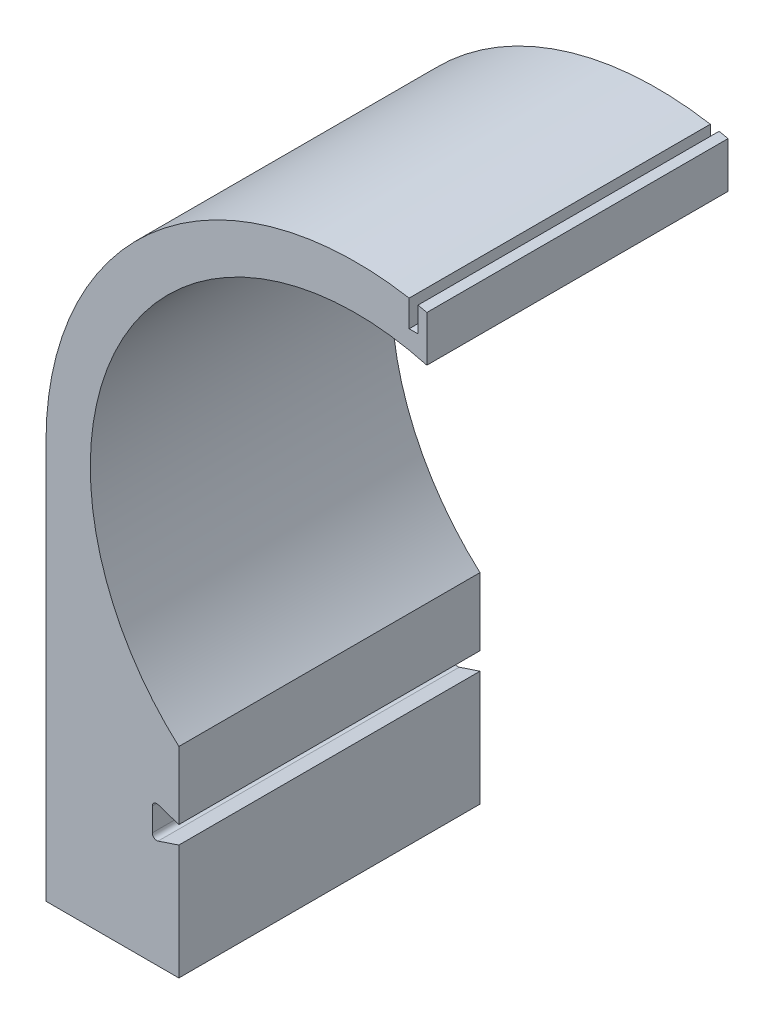
ISO-10303-21;
HEADER;
FILE_DESCRIPTION(('STEP AP214'),'2;1');
FILE_NAME('part.step','',(''),(''),'','','');
FILE_SCHEMA(('AUTOMOTIVE_DESIGN { 1 0 10303 214 1 1 1 1 }'));
ENDSEC;
DATA;
#1=APPLICATION_CONTEXT('core data for automotive mechanical design processes');
#2=APPLICATION_PROTOCOL_DEFINITION('international standard','automotive_design',2000,#1);
#3=PRODUCT_CONTEXT('',#1,'mechanical');
#4=PRODUCT('Part','Part','',(#3));
#5=PRODUCT_RELATED_PRODUCT_CATEGORY('part','',(#4));
#6=PRODUCT_DEFINITION_FORMATION('','',#4);
#7=PRODUCT_DEFINITION_CONTEXT('part definition',#1,'design');
#8=PRODUCT_DEFINITION('design','',#6,#7);
#9=PRODUCT_DEFINITION_SHAPE('','',#8);
#10=(LENGTH_UNIT() NAMED_UNIT(*) SI_UNIT(.MILLI.,.METRE.));
#11=(NAMED_UNIT(*) PLANE_ANGLE_UNIT() SI_UNIT($,.RADIAN.));
#12=(NAMED_UNIT(*) SI_UNIT($,.STERADIAN.) SOLID_ANGLE_UNIT());
#13=UNCERTAINTY_MEASURE_WITH_UNIT(LENGTH_MEASURE(1.E-05),#10,'distance_accuracy_value','');
#14=(GEOMETRIC_REPRESENTATION_CONTEXT(3) GLOBAL_UNCERTAINTY_ASSIGNED_CONTEXT((#13)) GLOBAL_UNIT_ASSIGNED_CONTEXT((#10,
#11,#12)) REPRESENTATION_CONTEXT('',''));
#15=CARTESIAN_POINT('',(0.,0.,0.));
#16=DIRECTION('',(0.,0.,1.));
#17=DIRECTION('',(1.,0.,0.));
#18=AXIS2_PLACEMENT_3D('',#15,#16,#17);
#19=CARTESIAN_POINT('',(0.,0.,170.));
#20=DIRECTION('',(0.,0.,-1.));
#21=DIRECTION('',(-1.,0.,0.));
#22=AXIS2_PLACEMENT_3D('',#19,#20,#21);
#23=CYLINDRICAL_SURFACE('',#22,175.);
#24=CARTESIAN_POINT('',(0.,0.,0.));
#25=DIRECTION('',(0.,0.,1.));
#26=DIRECTION('',(-1.,0.,0.));
#27=AXIS2_PLACEMENT_3D('',#24,#25,#26);
#28=CIRCLE('',#27,175.);
#29=CARTESIAN_POINT('',(40.,170.367250374008,0.));
#30=VERTEX_POINT('',#29);
#31=CARTESIAN_POINT('',(35.,171.464281994822,0.));
#32=VERTEX_POINT('',#31);
#33=EDGE_CURVE('E188',#30,#32,#28,.T.);
#34=ORIENTED_EDGE('',*,*,#33,.T.);
#35=DIRECTION('',(0.,0.,-1.));
#36=VECTOR('',#35,1.);
#37=CARTESIAN_POINT('',(35.,171.464281994822,170.));
#38=LINE('',#37,#36);
#39=CARTESIAN_POINT('',(35.,171.464281994822,170.));
#40=VERTEX_POINT('',#39);
#41=EDGE_CURVE('E11',#40,#32,#38,.T.);
#42=ORIENTED_EDGE('',*,*,#41,.F.);
#43=CARTESIAN_POINT('',(0.,0.,170.));
#44=DIRECTION('',(0.,0.,1.));
#45=DIRECTION('',(-1.,0.,0.));
#46=AXIS2_PLACEMENT_3D('',#43,#44,#45);
#47=CIRCLE('',#46,175.);
#48=CARTESIAN_POINT('',(40.,170.367250374008,170.));
#49=VERTEX_POINT('',#48);
#50=EDGE_CURVE('E234',#49,#40,#47,.T.);
#51=ORIENTED_EDGE('',*,*,#50,.F.);
#52=DIRECTION('',(0.,0.,-1.));
#53=VECTOR('',#52,1.);
#54=CARTESIAN_POINT('',(40.,170.367250374008,170.));
#55=LINE('',#54,#53);
#56=EDGE_CURVE('E184',#49,#30,#55,.T.);
#57=ORIENTED_EDGE('',*,*,#56,.T.);
#58=EDGE_LOOP('',(#34,#42,#51,#57));
#59=FACE_BOUND('',#58,.T.);
#60=ADVANCED_FACE('F39',(#59),#23,.T.);
#61=CARTESIAN_POINT('',(35.,171.464281994822,170.));
#62=DIRECTION('',(1.,0.,0.));
#63=DIRECTION('',(0.,1.,0.));
#64=AXIS2_PLACEMENT_3D('',#61,#62,#63);
#65=PLANE('',#64);
#66=DIRECTION('',(0.,-1.,0.));
#67=VECTOR('',#66,1.);
#68=CARTESIAN_POINT('',(35.,171.464281994822,0.));
#69=LINE('',#68,#67);
#70=CARTESIAN_POINT('',(35.,157.409396495667,0.));
#71=VERTEX_POINT('',#70);
#72=EDGE_CURVE('E192',#32,#71,#69,.T.);
#73=ORIENTED_EDGE('',*,*,#72,.T.);
#74=DIRECTION('',(0.,0.,-1.));
#75=VECTOR('',#74,1.);
#76=CARTESIAN_POINT('',(35.,157.409396495667,170.));
#77=LINE('',#76,#75);
#78=CARTESIAN_POINT('',(35.,157.409396495667,170.));
#79=VERTEX_POINT('',#78);
#80=EDGE_CURVE('E48',#79,#71,#77,.T.);
#81=ORIENTED_EDGE('',*,*,#80,.F.);
#82=DIRECTION('',(0.,-1.,0.));
#83=VECTOR('',#82,1.);
#84=CARTESIAN_POINT('',(35.,171.464281994822,170.));
#85=LINE('',#84,#83);
#86=EDGE_CURVE('E123',#40,#79,#85,.T.);
#87=ORIENTED_EDGE('',*,*,#86,.F.);
#88=ORIENTED_EDGE('',*,*,#41,.T.);
#89=EDGE_LOOP('',(#73,#81,#87,#88));
#90=FACE_BOUND('',#89,.T.);
#91=ADVANCED_FACE('F356',(#90),#65,.F.);
#92=CARTESIAN_POINT('',(35.,157.409396495667,170.));
#93=DIRECTION('',(0.,-1.,0.));
#94=DIRECTION('',(1.,0.,0.));
#95=AXIS2_PLACEMENT_3D('',#92,#93,#94);
#96=PLANE('',#95);
#97=DIRECTION('',(-1.,0.,0.));
#98=VECTOR('',#97,1.);
#99=CARTESIAN_POINT('',(35.,157.409396495667,0.));
#100=LINE('',#99,#98);
#101=CARTESIAN_POINT('',(30.,157.409396495667,0.));
#102=VERTEX_POINT('',#101);
#103=EDGE_CURVE('E195',#71,#102,#100,.T.);
#104=ORIENTED_EDGE('',*,*,#103,.T.);
#105=DIRECTION('',(0.,0.,-1.));
#106=VECTOR('',#105,1.);
#107=CARTESIAN_POINT('',(30.,157.409396495667,170.));
#108=LINE('',#107,#106);
#109=CARTESIAN_POINT('',(30.,157.409396495667,170.));
#110=VERTEX_POINT('',#109);
#111=EDGE_CURVE('E277',#110,#102,#108,.T.);
#112=ORIENTED_EDGE('',*,*,#111,.F.);
#113=DIRECTION('',(-1.,0.,0.));
#114=VECTOR('',#113,1.);
#115=CARTESIAN_POINT('',(35.,157.409396495667,170.));
#116=LINE('',#115,#114);
#117=EDGE_CURVE('E287',#79,#110,#116,.T.);
#118=ORIENTED_EDGE('',*,*,#117,.F.);
#119=ORIENTED_EDGE('',*,*,#80,.T.);
#120=EDGE_LOOP('',(#104,#112,#118,#119));
#121=FACE_BOUND('',#120,.T.);
#122=ADVANCED_FACE('F285',(#121),#96,.F.);
#123=CARTESIAN_POINT('',(30.,157.409396495667,170.));
#124=DIRECTION('',(-1.,0.,0.));
#125=DIRECTION('',(0.,0.,1.));
#126=AXIS2_PLACEMENT_3D('',#123,#124,#125);
#127=PLANE('',#126);
#128=DIRECTION('',(0.,1.,0.));
#129=VECTOR('',#128,1.);
#130=CARTESIAN_POINT('',(30.,157.409396495667,0.));
#131=LINE('',#130,#129);
#132=CARTESIAN_POINT('',(30.,172.409396495667,0.));
#133=VERTEX_POINT('',#132);
#134=EDGE_CURVE('E198',#102,#133,#131,.T.);
#135=ORIENTED_EDGE('',*,*,#134,.T.);
#136=DIRECTION('',(0.,0.,-1.));
#137=VECTOR('',#136,1.);
#138=CARTESIAN_POINT('',(30.,172.409396495667,170.));
#139=LINE('',#138,#137);
#140=CARTESIAN_POINT('',(30.,172.409396495667,170.));
#141=VERTEX_POINT('',#140);
#142=EDGE_CURVE('E273',#141,#133,#139,.T.);
#143=ORIENTED_EDGE('',*,*,#142,.F.);
#144=DIRECTION('',(0.,1.,0.));
#145=VECTOR('',#144,1.);
#146=CARTESIAN_POINT('',(30.,157.409396495667,170.));
#147=LINE('',#146,#145);
#148=EDGE_CURVE('E306',#110,#141,#147,.T.);
#149=ORIENTED_EDGE('',*,*,#148,.F.);
#150=ORIENTED_EDGE('',*,*,#111,.T.);
#151=EDGE_LOOP('',(#135,#143,#149,#150));
#152=FACE_BOUND('',#151,.T.);
#153=ADVANCED_FACE('F296',(#152),#127,.F.);
#154=CARTESIAN_POINT('',(0.,0.,170.));
#155=DIRECTION('',(0.,0.,-1.));
#156=DIRECTION('',(-1.,0.,0.));
#157=AXIS2_PLACEMENT_3D('',#154,#155,#156);
#158=CYLINDRICAL_SURFACE('',#157,175.);
#159=CARTESIAN_POINT('',(0.,0.,0.));
#160=DIRECTION('',(0.,0.,1.));
#161=DIRECTION('',(-1.,0.,0.));
#162=AXIS2_PLACEMENT_3D('',#159,#160,#161);
#163=CIRCLE('',#162,175.);
#164=CARTESIAN_POINT('',(-175.,0.,0.));
#165=VERTEX_POINT('',#164);
#166=EDGE_CURVE('E201',#133,#165,#163,.T.);
#167=ORIENTED_EDGE('',*,*,#166,.T.);
#168=DIRECTION('',(0.,0.,-1.));
#169=VECTOR('',#168,1.);
#170=CARTESIAN_POINT('',(-175.,0.,170.));
#171=LINE('',#170,#169);
#172=CARTESIAN_POINT('',(-175.,0.,170.));
#173=VERTEX_POINT('',#172);
#174=EDGE_CURVE('E269',#173,#165,#171,.T.);
#175=ORIENTED_EDGE('',*,*,#174,.F.);
#176=CARTESIAN_POINT('',(0.,0.,170.));
#177=DIRECTION('',(0.,0.,1.));
#178=DIRECTION('',(-1.,0.,0.));
#179=AXIS2_PLACEMENT_3D('',#176,#177,#178);
#180=CIRCLE('',#179,175.);
#181=EDGE_CURVE('E302',#141,#173,#180,.T.);
#182=ORIENTED_EDGE('',*,*,#181,.F.);
#183=ORIENTED_EDGE('',*,*,#142,.T.);
#184=EDGE_LOOP('',(#167,#175,#182,#183));
#185=FACE_BOUND('',#184,.T.);
#186=ADVANCED_FACE('F300',(#185),#158,.T.);
#187=CARTESIAN_POINT('',(-175.,0.,170.));
#188=DIRECTION('',(1.,0.,0.));
#189=DIRECTION('',(0.,1.,0.));
#190=AXIS2_PLACEMENT_3D('',#187,#188,#189);
#191=PLANE('',#190);
#192=DIRECTION('',(0.,-1.,0.));
#193=VECTOR('',#192,1.);
#194=CARTESIAN_POINT('',(-175.,0.,0.));
#195=LINE('',#194,#193);
#196=CARTESIAN_POINT('',(-175.,-225.,0.));
#197=VERTEX_POINT('',#196);
#198=EDGE_CURVE('E204',#165,#197,#195,.T.);
#199=ORIENTED_EDGE('',*,*,#198,.T.);
#200=DIRECTION('',(0.,0.,-1.));
#201=VECTOR('',#200,1.);
#202=CARTESIAN_POINT('',(-175.,-225.,170.));
#203=LINE('',#202,#201);
#204=CARTESIAN_POINT('',(-175.,-225.,170.));
#205=VERTEX_POINT('',#204);
#206=EDGE_CURVE('E265',#205,#197,#203,.T.);
#207=ORIENTED_EDGE('',*,*,#206,.F.);
#208=DIRECTION('',(0.,-1.,0.));
#209=VECTOR('',#208,1.);
#210=CARTESIAN_POINT('',(-175.,0.,170.));
#211=LINE('',#210,#209);
#212=EDGE_CURVE('E305',#173,#205,#211,.T.);
#213=ORIENTED_EDGE('',*,*,#212,.F.);
#214=ORIENTED_EDGE('',*,*,#174,.T.);
#215=EDGE_LOOP('',(#199,#207,#213,#214));
#216=FACE_BOUND('',#215,.T.);
#217=ADVANCED_FACE('F369',(#216),#191,.F.);
#218=CARTESIAN_POINT('',(-100.,-225.,170.));
#219=DIRECTION('',(0.,1.,0.));
#220=DIRECTION('',(0.,0.,1.));
#221=AXIS2_PLACEMENT_3D('',#218,#219,#220);
#222=PLANE('',#221);
#223=DIRECTION('',(1.,0.,0.));
#224=VECTOR('',#223,1.);
#225=CARTESIAN_POINT('',(-100.,-225.,0.));
#226=LINE('',#225,#224);
#227=CARTESIAN_POINT('',(-100.,-225.,0.));
#228=VERTEX_POINT('',#227);
#229=EDGE_CURVE('E207',#197,#228,#226,.T.);
#230=ORIENTED_EDGE('',*,*,#229,.T.);
#231=DIRECTION('',(0.,0.,-1.));
#232=VECTOR('',#231,1.);
#233=CARTESIAN_POINT('',(-100.,-225.,170.));
#234=LINE('',#233,#232);
#235=CARTESIAN_POINT('',(-100.,-225.,170.));
#236=VERTEX_POINT('',#235);
#237=EDGE_CURVE('E261',#236,#228,#234,.T.);
#238=ORIENTED_EDGE('',*,*,#237,.F.);
#239=DIRECTION('',(1.,0.,0.));
#240=VECTOR('',#239,1.);
#241=CARTESIAN_POINT('',(-100.,-225.,170.));
#242=LINE('',#241,#240);
#243=EDGE_CURVE('E310',#205,#236,#242,.T.);
#244=ORIENTED_EDGE('',*,*,#243,.F.);
#245=ORIENTED_EDGE('',*,*,#206,.T.);
#246=EDGE_LOOP('',(#230,#238,#244,#245));
#247=FACE_BOUND('',#246,.T.);
#248=ADVANCED_FACE('F372',(#247),#222,.F.);
#249=CARTESIAN_POINT('',(-100.,-160.,170.));
#250=DIRECTION('',(-1.,0.,0.));
#251=DIRECTION('',(0.,-1.,0.));
#252=AXIS2_PLACEMENT_3D('',#249,#250,#251);
#253=PLANE('',#252);
#254=DIRECTION('',(0.,1.,0.));
#255=VECTOR('',#254,1.);
#256=CARTESIAN_POINT('',(-100.,-160.,0.));
#257=LINE('',#256,#255);
#258=CARTESIAN_POINT('',(-100.,-160.,0.));
#259=VERTEX_POINT('',#258);
#260=EDGE_CURVE('E210',#228,#259,#257,.T.);
#261=ORIENTED_EDGE('',*,*,#260,.T.);
#262=DIRECTION('',(0.,0.,-1.));
#263=VECTOR('',#262,1.);
#264=CARTESIAN_POINT('',(-100.,-160.,170.));
#265=LINE('',#264,#263);
#266=CARTESIAN_POINT('',(-100.,-160.,170.));
#267=VERTEX_POINT('',#266);
#268=EDGE_CURVE('E257',#267,#259,#265,.T.);
#269=ORIENTED_EDGE('',*,*,#268,.F.);
#270=DIRECTION('',(0.,1.,0.));
#271=VECTOR('',#270,1.);
#272=CARTESIAN_POINT('',(-100.,-160.,170.));
#273=LINE('',#272,#271);
#274=EDGE_CURVE('E317',#236,#267,#273,.T.);
#275=ORIENTED_EDGE('',*,*,#274,.F.);
#276=ORIENTED_EDGE('',*,*,#237,.T.);
#277=EDGE_LOOP('',(#261,#269,#275,#276));
#278=FACE_BOUND('',#277,.T.);
#279=ADVANCED_FACE('F376',(#278),#253,.F.);
#280=CARTESIAN_POINT('',(-100.,-160.,170.));
#281=DIRECTION('',(0.316227766016834,-0.948683298050515,0.));
#282=DIRECTION('',(0.948683298050515,0.316227766016834,0.));
#283=AXIS2_PLACEMENT_3D('',#280,#281,#282);
#284=PLANE('',#283);
#285=DIRECTION('',(-0.948683298050515,-0.316227766016834,0.));
#286=VECTOR('',#285,1.);
#287=CARTESIAN_POINT('',(-100.,-160.,0.));
#288=LINE('',#287,#286);
#289=CARTESIAN_POINT('',(-111.709430584958,-163.903143528319,0.));
#290=VERTEX_POINT('',#289);
#291=EDGE_CURVE('E213',#259,#290,#288,.T.);
#292=ORIENTED_EDGE('',*,*,#291,.T.);
#293=DIRECTION('',(0.,0.,-1.));
#294=VECTOR('',#293,1.);
#295=CARTESIAN_POINT('',(-111.709430584958,-163.903143528319,170.));
#296=LINE('',#295,#294);
#297=CARTESIAN_POINT('',(-111.709430584958,-163.903143528319,170.));
#298=VERTEX_POINT('',#297);
#299=EDGE_CURVE('E253',#298,#290,#296,.T.);
#300=ORIENTED_EDGE('',*,*,#299,.F.);
#301=DIRECTION('',(-0.948683298050515,-0.316227766016834,0.));
#302=VECTOR('',#301,1.);
#303=CARTESIAN_POINT('',(-100.,-160.,170.));
#304=LINE('',#303,#302);
#305=EDGE_CURVE('E320',#267,#298,#304,.T.);
#306=ORIENTED_EDGE('',*,*,#305,.F.);
#307=ORIENTED_EDGE('',*,*,#268,.T.);
#308=EDGE_LOOP('',(#292,#300,#306,#307));
#309=FACE_BOUND('',#308,.T.);
#310=ADVANCED_FACE('F380',(#309),#284,.F.);
#311=CARTESIAN_POINT('',(-112.5,-161.531435283193,170.));
#312=DIRECTION('',(0.,0.,-1.));
#313=DIRECTION('',(-1.,0.,0.));
#314=AXIS2_PLACEMENT_3D('',#311,#312,#313);
#315=CYLINDRICAL_SURFACE('',#314,2.5);
#316=CARTESIAN_POINT('',(-112.5,-161.531435283193,0.));
#317=DIRECTION('',(0.,0.,-1.));
#318=DIRECTION('',(1.,0.,0.));
#319=AXIS2_PLACEMENT_3D('',#316,#317,#318);
#320=CIRCLE('',#319,2.5);
#321=CARTESIAN_POINT('',(-115.,-161.531435283193,0.));
#322=VERTEX_POINT('',#321);
#323=EDGE_CURVE('E216',#290,#322,#320,.T.);
#324=ORIENTED_EDGE('',*,*,#323,.T.);
#325=DIRECTION('',(0.,0.,-1.));
#326=VECTOR('',#325,1.);
#327=CARTESIAN_POINT('',(-115.,-161.531435283193,170.));
#328=LINE('',#327,#326);
#329=CARTESIAN_POINT('',(-115.,-161.531435283193,170.));
#330=VERTEX_POINT('',#329);
#331=EDGE_CURVE('E249',#330,#322,#328,.T.);
#332=ORIENTED_EDGE('',*,*,#331,.F.);
#333=CARTESIAN_POINT('',(-112.5,-161.531435283193,170.));
#334=DIRECTION('',(0.,0.,-1.));
#335=DIRECTION('',(1.,0.,0.));
#336=AXIS2_PLACEMENT_3D('',#333,#334,#335);
#337=CIRCLE('',#336,2.5);
#338=EDGE_CURVE('E323',#298,#330,#337,.T.);
#339=ORIENTED_EDGE('',*,*,#338,.F.);
#340=ORIENTED_EDGE('',*,*,#299,.T.);
#341=EDGE_LOOP('',(#324,#332,#339,#340));
#342=FACE_BOUND('',#341,.T.);
#343=ADVANCED_FACE('F384',(#342),#315,.F.);
#344=CARTESIAN_POINT('',(-115.,-161.531435283193,170.));
#345=DIRECTION('',(-1.,0.,0.));
#346=DIRECTION('',(0.,0.,1.));
#347=AXIS2_PLACEMENT_3D('',#344,#345,#346);
#348=PLANE('',#347);
#349=DIRECTION('',(0.,1.,0.));
#350=VECTOR('',#349,1.);
#351=CARTESIAN_POINT('',(-115.,-161.531435283193,0.));
#352=LINE('',#351,#350);
#353=CARTESIAN_POINT('',(-115.,-148.468564716807,0.));
#354=VERTEX_POINT('',#353);
#355=EDGE_CURVE('E219',#322,#354,#352,.T.);
#356=ORIENTED_EDGE('',*,*,#355,.T.);
#357=DIRECTION('',(0.,0.,-1.));
#358=VECTOR('',#357,1.);
#359=CARTESIAN_POINT('',(-115.,-148.468564716807,170.));
#360=LINE('',#359,#358);
#361=CARTESIAN_POINT('',(-115.,-148.468564716807,170.));
#362=VERTEX_POINT('',#361);
#363=EDGE_CURVE('E245',#362,#354,#360,.T.);
#364=ORIENTED_EDGE('',*,*,#363,.F.);
#365=DIRECTION('',(0.,1.,0.));
#366=VECTOR('',#365,1.);
#367=CARTESIAN_POINT('',(-115.,-161.531435283193,170.));
#368=LINE('',#367,#366);
#369=EDGE_CURVE('E326',#330,#362,#368,.T.);
#370=ORIENTED_EDGE('',*,*,#369,.F.);
#371=ORIENTED_EDGE('',*,*,#331,.T.);
#372=EDGE_LOOP('',(#356,#364,#370,#371));
#373=FACE_BOUND('',#372,.T.);
#374=ADVANCED_FACE('F388',(#373),#348,.F.);
#375=CARTESIAN_POINT('',(-112.5,-148.468564716807,170.));
#376=DIRECTION('',(0.,0.,-1.));
#377=DIRECTION('',(-1.,0.,0.));
#378=AXIS2_PLACEMENT_3D('',#375,#376,#377);
#379=CYLINDRICAL_SURFACE('',#378,2.5);
#380=CARTESIAN_POINT('',(-112.5,-148.468564716807,0.));
#381=DIRECTION('',(0.,0.,-1.));
#382=DIRECTION('',(-1.,0.,0.));
#383=AXIS2_PLACEMENT_3D('',#380,#381,#382);
#384=CIRCLE('',#383,2.5);
#385=CARTESIAN_POINT('',(-111.709430584958,-146.096856471681,0.));
#386=VERTEX_POINT('',#385);
#387=EDGE_CURVE('E222',#354,#386,#384,.T.);
#388=ORIENTED_EDGE('',*,*,#387,.T.);
#389=DIRECTION('',(0.,0.,-1.));
#390=VECTOR('',#389,1.);
#391=CARTESIAN_POINT('',(-111.709430584958,-146.096856471681,170.));
#392=LINE('',#391,#390);
#393=CARTESIAN_POINT('',(-111.709430584958,-146.096856471681,170.));
#394=VERTEX_POINT('',#393);
#395=EDGE_CURVE('E241',#394,#386,#392,.T.);
#396=ORIENTED_EDGE('',*,*,#395,.F.);
#397=CARTESIAN_POINT('',(-112.5,-148.468564716807,170.));
#398=DIRECTION('',(0.,0.,-1.));
#399=DIRECTION('',(-1.,0.,0.));
#400=AXIS2_PLACEMENT_3D('',#397,#398,#399);
#401=CIRCLE('',#400,2.5);
#402=EDGE_CURVE('E329',#362,#394,#401,.T.);
#403=ORIENTED_EDGE('',*,*,#402,.F.);
#404=ORIENTED_EDGE('',*,*,#363,.T.);
#405=EDGE_LOOP('',(#388,#396,#403,#404));
#406=FACE_BOUND('',#405,.T.);
#407=ADVANCED_FACE('F337',(#406),#379,.F.);
#408=CARTESIAN_POINT('',(-111.709430584958,-146.096856471681,170.));
#409=DIRECTION('',(0.316227766016838,0.948683298050514,0.));
#410=DIRECTION('',(-0.948683298050514,0.316227766016838,0.));
#411=AXIS2_PLACEMENT_3D('',#408,#409,#410);
#412=PLANE('',#411);
#413=DIRECTION('',(0.948683298050514,-0.316227766016838,0.));
#414=VECTOR('',#413,1.);
#415=CARTESIAN_POINT('',(-111.709430584958,-146.096856471681,0.));
#416=LINE('',#415,#414);
#417=CARTESIAN_POINT('',(-100.,-150.,0.));
#418=VERTEX_POINT('',#417);
#419=EDGE_CURVE('E225',#386,#418,#416,.T.);
#420=ORIENTED_EDGE('',*,*,#419,.T.);
#421=DIRECTION('',(0.,0.,-1.));
#422=VECTOR('',#421,1.);
#423=CARTESIAN_POINT('',(-100.,-150.,170.));
#424=LINE('',#423,#422);
#425=CARTESIAN_POINT('',(-100.,-150.,170.));
#426=VERTEX_POINT('',#425);
#427=EDGE_CURVE('E177',#426,#418,#424,.T.);
#428=ORIENTED_EDGE('',*,*,#427,.F.);
#429=DIRECTION('',(0.948683298050514,-0.316227766016838,0.));
#430=VECTOR('',#429,1.);
#431=CARTESIAN_POINT('',(-111.709430584958,-146.096856471681,170.));
#432=LINE('',#431,#430);
#433=EDGE_CURVE('E166',#394,#426,#432,.T.);
#434=ORIENTED_EDGE('',*,*,#433,.F.);
#435=ORIENTED_EDGE('',*,*,#395,.T.);
#436=EDGE_LOOP('',(#420,#428,#434,#435));
#437=FACE_BOUND('',#436,.T.);
#438=ADVANCED_FACE('F341',(#437),#412,.F.);
#439=CARTESIAN_POINT('',(-100.,-111.803398874989,170.));
#440=DIRECTION('',(-1.,0.,0.));
#441=DIRECTION('',(0.,0.,1.));
#442=AXIS2_PLACEMENT_3D('',#439,#440,#441);
#443=PLANE('',#442);
#444=DIRECTION('',(0.,1.,0.));
#445=VECTOR('',#444,1.);
#446=CARTESIAN_POINT('',(-100.,-111.803398874989,0.));
#447=LINE('',#446,#445);
#448=CARTESIAN_POINT('',(-100.,-111.803398874989,0.));
#449=VERTEX_POINT('',#448);
#450=EDGE_CURVE('E175',#418,#449,#447,.T.);
#451=ORIENTED_EDGE('',*,*,#450,.T.);
#452=DIRECTION('',(0.,0.,-1.));
#453=VECTOR('',#452,1.);
#454=CARTESIAN_POINT('',(-100.,-111.803398874989,170.));
#455=LINE('',#454,#453);
#456=CARTESIAN_POINT('',(-100.,-111.803398874989,170.));
#457=VERTEX_POINT('',#456);
#458=EDGE_CURVE('E172',#457,#449,#455,.T.);
#459=ORIENTED_EDGE('',*,*,#458,.F.);
#460=DIRECTION('',(0.,1.,0.));
#461=VECTOR('',#460,1.);
#462=CARTESIAN_POINT('',(-100.,-111.803398874989,170.));
#463=LINE('',#462,#461);
#464=EDGE_CURVE('E160',#426,#457,#463,.T.);
#465=ORIENTED_EDGE('',*,*,#464,.F.);
#466=ORIENTED_EDGE('',*,*,#427,.T.);
#467=EDGE_LOOP('',(#451,#459,#465,#466));
#468=FACE_BOUND('',#467,.T.);
#469=ADVANCED_FACE('F173',(#468),#443,.F.);
#470=CARTESIAN_POINT('',(0.,0.,170.));
#471=DIRECTION('',(0.,0.,-1.));
#472=DIRECTION('',(-1.,0.,0.));
#473=AXIS2_PLACEMENT_3D('',#470,#471,#472);
#474=CYLINDRICAL_SURFACE('',#473,150.);
#475=CARTESIAN_POINT('',(0.,0.,0.));
#476=DIRECTION('',(0.,0.,-1.));
#477=DIRECTION('',(-1.,0.,0.));
#478=AXIS2_PLACEMENT_3D('',#475,#476,#477);
#479=CIRCLE('',#478,150.);
#480=CARTESIAN_POINT('',(40.,144.56832294801,0.));
#481=VERTEX_POINT('',#480);
#482=EDGE_CURVE('E109',#449,#481,#479,.T.);
#483=ORIENTED_EDGE('',*,*,#482,.T.);
#484=DIRECTION('',(0.,0.,-1.));
#485=VECTOR('',#484,1.);
#486=CARTESIAN_POINT('',(40.,144.56832294801,170.));
#487=LINE('',#486,#485);
#488=CARTESIAN_POINT('',(40.,144.56832294801,170.));
#489=VERTEX_POINT('',#488);
#490=EDGE_CURVE('E178',#489,#481,#487,.T.);
#491=ORIENTED_EDGE('',*,*,#490,.F.);
#492=CARTESIAN_POINT('',(0.,0.,170.));
#493=DIRECTION('',(0.,0.,-1.));
#494=DIRECTION('',(-1.,0.,0.));
#495=AXIS2_PLACEMENT_3D('',#492,#493,#494);
#496=CIRCLE('',#495,150.);
#497=EDGE_CURVE('E164',#457,#489,#496,.T.);
#498=ORIENTED_EDGE('',*,*,#497,.F.);
#499=ORIENTED_EDGE('',*,*,#458,.T.);
#500=EDGE_LOOP('',(#483,#491,#498,#499));
#501=FACE_BOUND('',#500,.T.);
#502=ADVANCED_FACE('F180',(#501),#474,.F.);
#503=CARTESIAN_POINT('',(40.,170.367250374008,170.));
#504=DIRECTION('',(-1.,0.,0.));
#505=DIRECTION('',(0.,0.,1.));
#506=AXIS2_PLACEMENT_3D('',#503,#504,#505);
#507=PLANE('',#506);
#508=DIRECTION('',(0.,1.,0.));
#509=VECTOR('',#508,1.);
#510=CARTESIAN_POINT('',(40.,170.367250374008,0.));
#511=LINE('',#510,#509);
#512=EDGE_CURVE('E115',#481,#30,#511,.T.);
#513=ORIENTED_EDGE('',*,*,#512,.T.);
#514=ORIENTED_EDGE('',*,*,#56,.F.);
#515=DIRECTION('',(0.,1.,0.));
#516=VECTOR('',#515,1.);
#517=CARTESIAN_POINT('',(40.,170.367250374008,170.));
#518=LINE('',#517,#516);
#519=EDGE_CURVE('E56',#489,#49,#518,.T.);
#520=ORIENTED_EDGE('',*,*,#519,.F.);
#521=ORIENTED_EDGE('',*,*,#490,.T.);
#522=EDGE_LOOP('',(#513,#514,#520,#521));
#523=FACE_BOUND('',#522,.T.);
#524=ADVANCED_FACE('F345',(#523),#507,.F.);
#525=CARTESIAN_POINT('',(0.,0.,170.));
#526=DIRECTION('',(0.,0.,-1.));
#527=DIRECTION('',(-1.,0.,0.));
#528=AXIS2_PLACEMENT_3D('',#525,#526,#527);
#529=PLANE('',#528);
#530=ORIENTED_EDGE('',*,*,#50,.T.);
#531=ORIENTED_EDGE('',*,*,#86,.T.);
#532=ORIENTED_EDGE('',*,*,#117,.T.);
#533=ORIENTED_EDGE('',*,*,#148,.T.);
#534=ORIENTED_EDGE('',*,*,#181,.T.);
#535=ORIENTED_EDGE('',*,*,#212,.T.);
#536=ORIENTED_EDGE('',*,*,#243,.T.);
#537=ORIENTED_EDGE('',*,*,#274,.T.);
#538=ORIENTED_EDGE('',*,*,#305,.T.);
#539=ORIENTED_EDGE('',*,*,#338,.T.);
#540=ORIENTED_EDGE('',*,*,#369,.T.);
#541=ORIENTED_EDGE('',*,*,#402,.T.);
#542=ORIENTED_EDGE('',*,*,#433,.T.);
#543=ORIENTED_EDGE('',*,*,#464,.T.);
#544=ORIENTED_EDGE('',*,*,#497,.T.);
#545=ORIENTED_EDGE('',*,*,#519,.T.);
#546=EDGE_LOOP('',(#530,#531,#532,#533,#534,#535,#536,#537,#538,#539,#540,#541,#542,#543,#544,#545));
#547=FACE_BOUND('',#546,.T.);
#548=ADVANCED_FACE('F162',(#547),#529,.F.);
#549=CARTESIAN_POINT('',(0.,0.,0.));
#550=DIRECTION('',(0.,0.,-1.));
#551=DIRECTION('',(-1.,0.,0.));
#552=AXIS2_PLACEMENT_3D('',#549,#550,#551);
#553=PLANE('',#552);
#554=ORIENTED_EDGE('',*,*,#33,.F.);
#555=ORIENTED_EDGE('',*,*,#512,.F.);
#556=ORIENTED_EDGE('',*,*,#482,.F.);
#557=ORIENTED_EDGE('',*,*,#450,.F.);
#558=ORIENTED_EDGE('',*,*,#419,.F.);
#559=ORIENTED_EDGE('',*,*,#387,.F.);
#560=ORIENTED_EDGE('',*,*,#355,.F.);
#561=ORIENTED_EDGE('',*,*,#323,.F.);
#562=ORIENTED_EDGE('',*,*,#291,.F.);
#563=ORIENTED_EDGE('',*,*,#260,.F.);
#564=ORIENTED_EDGE('',*,*,#229,.F.);
#565=ORIENTED_EDGE('',*,*,#198,.F.);
#566=ORIENTED_EDGE('',*,*,#166,.F.);
#567=ORIENTED_EDGE('',*,*,#134,.F.);
#568=ORIENTED_EDGE('',*,*,#103,.F.);
#569=ORIENTED_EDGE('',*,*,#72,.F.);
#570=EDGE_LOOP('',(#554,#555,#556,#557,#558,#559,#560,#561,#562,#563,#564,#565,#566,#567,#568,#569));
#571=FACE_BOUND('',#570,.T.);
#572=ADVANCED_FACE('F291',(#571),#553,.T.);
#573=CLOSED_SHELL('',(#60,#91,#122,#153,#186,#217,#248,#279,#310,#343,#374,#407,#438,#469,#502,
#524,#548,#572));
#574=MANIFOLD_SOLID_BREP('B2',#573);
#575=ADVANCED_BREP_SHAPE_REPRESENTATION('',(#18,#574),#14);
#576=SHAPE_DEFINITION_REPRESENTATION(#9,#575);
ENDSEC;
END-ISO-10303-21;
